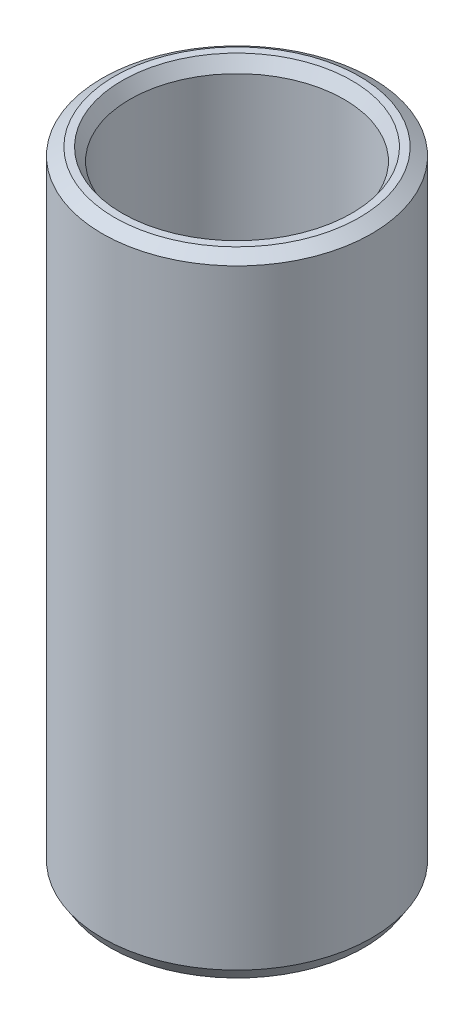
ISO-10303-21;
HEADER;
FILE_DESCRIPTION(('STEP AP214'),'2;1');
FILE_NAME('part.step','',(''),(''),'','','');
FILE_SCHEMA(('AUTOMOTIVE_DESIGN { 1 0 10303 214 1 1 1 1 }'));
ENDSEC;
DATA;
#1=APPLICATION_CONTEXT('core data for automotive mechanical design processes');
#2=APPLICATION_PROTOCOL_DEFINITION('international standard','automotive_design',2000,#1);
#3=PRODUCT_CONTEXT('',#1,'mechanical');
#4=PRODUCT('Part','Part','',(#3));
#5=PRODUCT_RELATED_PRODUCT_CATEGORY('part','',(#4));
#6=PRODUCT_DEFINITION_FORMATION('','',#4);
#7=PRODUCT_DEFINITION_CONTEXT('part definition',#1,'design');
#8=PRODUCT_DEFINITION('design','',#6,#7);
#9=PRODUCT_DEFINITION_SHAPE('','',#8);
#10=(LENGTH_UNIT() NAMED_UNIT(*) SI_UNIT(.MILLI.,.METRE.));
#11=(NAMED_UNIT(*) PLANE_ANGLE_UNIT() SI_UNIT($,.RADIAN.));
#12=(NAMED_UNIT(*) SI_UNIT($,.STERADIAN.) SOLID_ANGLE_UNIT());
#13=UNCERTAINTY_MEASURE_WITH_UNIT(LENGTH_MEASURE(1.E-05),#10,'distance_accuracy_value','');
#14=(GEOMETRIC_REPRESENTATION_CONTEXT(3) GLOBAL_UNCERTAINTY_ASSIGNED_CONTEXT((#13)) GLOBAL_UNIT_ASSIGNED_CONTEXT((#10,
#11,#12)) REPRESENTATION_CONTEXT('',''));
#15=CARTESIAN_POINT('',(0.,0.,0.));
#16=DIRECTION('',(0.,0.,1.));
#17=DIRECTION('',(1.,0.,0.));
#18=AXIS2_PLACEMENT_3D('',#15,#16,#17);
#19=CARTESIAN_POINT('',(0.,163.63805403778,0.));
#20=DIRECTION('',(0.,-1.,0.));
#21=DIRECTION('',(0.,0.,-1.));
#22=AXIS2_PLACEMENT_3D('',#19,#20,#21);
#23=CYLINDRICAL_SURFACE('',#22,35.);
#24=CARTESIAN_POINT('',(0.,3.19734779818565,0.));
#25=DIRECTION('',(0.,1.,0.));
#26=DIRECTION('',(0.,0.,1.));
#27=AXIS2_PLACEMENT_3D('',#24,#25,#26);
#28=CIRCLE('',#27,35.);
#29=CARTESIAN_POINT('',(0.,3.19734779818565,35.));
#30=VERTEX_POINT('',#29);
#31=EDGE_CURVE('E10',#30,#30,#28,.T.);
#32=ORIENTED_EDGE('',*,*,#31,.T.);
#33=EDGE_LOOP('',(#32));
#34=FACE_BOUND('',#33,.T.);
#35=CARTESIAN_POINT('',(0.,161.61145353073,0.));
#36=DIRECTION('',(0.,1.,0.));
#37=DIRECTION('',(0.,0.,1.));
#38=AXIS2_PLACEMENT_3D('',#35,#36,#37);
#39=CIRCLE('',#38,35.);
#40=CARTESIAN_POINT('',(0.,161.61145353073,35.));
#41=VERTEX_POINT('',#40);
#42=EDGE_CURVE('E50',#41,#41,#39,.F.);
#43=ORIENTED_EDGE('',*,*,#42,.T.);
#44=EDGE_LOOP('',(#43));
#45=FACE_BOUND('',#44,.T.);
#46=ADVANCED_FACE('F39',(#34,#45),#23,.T.);
#47=CARTESIAN_POINT('',(0.,163.63805403778,0.));
#48=DIRECTION('',(0.,1.,0.));
#49=DIRECTION('',(0.,0.,1.));
#50=AXIS2_PLACEMENT_3D('',#47,#48,#49);
#51=PLANE('',#50);
#52=CARTESIAN_POINT('',(0.,163.63805403778,0.));
#53=DIRECTION('',(0.,1.,0.));
#54=DIRECTION('',(0.,0.,1.));
#55=AXIS2_PLACEMENT_3D('',#52,#53,#54);
#56=CIRCLE('',#55,29.8465882350042);
#57=CARTESIAN_POINT('',(0.,163.63805403778,29.8465882350042));
#58=VERTEX_POINT('',#57);
#59=EDGE_CURVE('E58',#58,#58,#56,.F.);
#60=ORIENTED_EDGE('',*,*,#59,.T.);
#61=EDGE_LOOP('',(#60));
#62=FACE_BOUND('',#61,.T.);
#63=CARTESIAN_POINT('',(0.,163.63805403778,0.));
#64=DIRECTION('',(0.,1.,0.));
#65=DIRECTION('',(0.,0.,1.));
#66=AXIS2_PLACEMENT_3D('',#63,#64,#65);
#67=CIRCLE('',#66,31.8026522018143);
#68=CARTESIAN_POINT('',(0.,163.63805403778,31.8026522018143));
#69=VERTEX_POINT('',#68);
#70=EDGE_CURVE('E61',#69,#69,#67,.T.);
#71=ORIENTED_EDGE('',*,*,#70,.T.);
#72=EDGE_LOOP('',(#71));
#73=FACE_BOUND('',#72,.T.);
#74=ADVANCED_FACE('F88',(#62,#73),#51,.T.);
#75=CARTESIAN_POINT('',(0.,0.,0.));
#76=DIRECTION('',(0.,1.,0.));
#77=DIRECTION('',(0.,0.,1.));
#78=AXIS2_PLACEMENT_3D('',#75,#76,#77);
#79=PLANE('',#78);
#80=CARTESIAN_POINT('',(0.,0.,0.));
#81=DIRECTION('',(0.,1.,0.));
#82=DIRECTION('',(0.,0.,1.));
#83=AXIS2_PLACEMENT_3D('',#80,#81,#82);
#84=CIRCLE('',#83,31.0173355261397);
#85=CARTESIAN_POINT('',(0.,0.,31.0173355261397));
#86=VERTEX_POINT('',#85);
#87=EDGE_CURVE('E51',#86,#86,#84,.T.);
#88=ORIENTED_EDGE('',*,*,#87,.T.);
#89=EDGE_LOOP('',(#88));
#90=FACE_BOUND('',#89,.T.);
#91=CARTESIAN_POINT('',(0.,0.,0.));
#92=DIRECTION('',(0.,1.,0.));
#93=DIRECTION('',(0.,0.,1.));
#94=AXIS2_PLACEMENT_3D('',#91,#92,#93);
#95=CIRCLE('',#94,32.9733994929498);
#96=CARTESIAN_POINT('',(0.,0.,32.9733994929498));
#97=VERTEX_POINT('',#96);
#98=EDGE_CURVE('E54',#97,#97,#95,.F.);
#99=ORIENTED_EDGE('',*,*,#98,.T.);
#100=EDGE_LOOP('',(#99));
#101=FACE_BOUND('',#100,.T.);
#102=ADVANCED_FACE('F83',(#90,#101),#79,.F.);
#103=CARTESIAN_POINT('',(0.,163.63805403778,0.));
#104=DIRECTION('',(0.,-1.,0.));
#105=DIRECTION('',(0.,0.,-1.));
#106=AXIS2_PLACEMENT_3D('',#103,#104,#105);
#107=CYLINDRICAL_SURFACE('',#106,27.8199877279541);
#108=CARTESIAN_POINT('',(0.,160.440706239594,0.));
#109=DIRECTION('',(0.,1.,0.));
#110=DIRECTION('',(0.,0.,1.));
#111=AXIS2_PLACEMENT_3D('',#108,#109,#110);
#112=CIRCLE('',#111,27.8199877279541);
#113=CARTESIAN_POINT('',(0.,160.440706239594,27.8199877279541));
#114=VERTEX_POINT('',#113);
#115=EDGE_CURVE('E67',#114,#114,#112,.T.);
#116=ORIENTED_EDGE('',*,*,#115,.T.);
#117=EDGE_LOOP('',(#116));
#118=FACE_BOUND('',#117,.T.);
#119=CARTESIAN_POINT('',(0.,2.02660050705014,0.));
#120=DIRECTION('',(0.,1.,0.));
#121=DIRECTION('',(0.,0.,1.));
#122=AXIS2_PLACEMENT_3D('',#119,#120,#121);
#123=CIRCLE('',#122,27.8199877279541);
#124=CARTESIAN_POINT('',(0.,2.02660050705014,27.8199877279541));
#125=VERTEX_POINT('',#124);
#126=EDGE_CURVE('E69',#125,#125,#123,.F.);
#127=ORIENTED_EDGE('',*,*,#126,.T.);
#128=EDGE_LOOP('',(#127));
#129=FACE_BOUND('',#128,.T.);
#130=ADVANCED_FACE('F71',(#118,#129),#107,.F.);
#131=CARTESIAN_POINT('',(0.,160.440706239594,0.));
#132=DIRECTION('',(0.,1.,0.));
#133=DIRECTION('',(0.,0.,1.));
#134=AXIS2_PLACEMENT_3D('',#131,#132,#133);
#135=CONICAL_SURFACE('',#134,27.8199877279541,0.564929495882043);
#136=ORIENTED_EDGE('',*,*,#59,.F.);
#137=EDGE_LOOP('',(#136));
#138=FACE_BOUND('',#137,.T.);
#139=ORIENTED_EDGE('',*,*,#115,.F.);
#140=EDGE_LOOP('',(#139));
#141=FACE_BOUND('',#140,.T.);
#142=ADVANCED_FACE('F77',(#138,#141),#135,.F.);
#143=CARTESIAN_POINT('',(0.,0.,0.));
#144=DIRECTION('',(0.,-1.,0.));
#145=DIRECTION('',(0.,0.,-1.));
#146=AXIS2_PLACEMENT_3D('',#143,#144,#145);
#147=CONICAL_SURFACE('',#146,31.0173355261397,1.00586683091285);
#148=ORIENTED_EDGE('',*,*,#126,.F.);
#149=EDGE_LOOP('',(#148));
#150=FACE_BOUND('',#149,.T.);
#151=ORIENTED_EDGE('',*,*,#87,.F.);
#152=EDGE_LOOP('',(#151));
#153=FACE_BOUND('',#152,.T.);
#154=ADVANCED_FACE('F73',(#150,#153),#147,.F.);
#155=CARTESIAN_POINT('',(0.,3.19734779818565,0.));
#156=DIRECTION('',(0.,1.,0.));
#157=DIRECTION('',(0.,0.,1.));
#158=AXIS2_PLACEMENT_3D('',#155,#156,#157);
#159=CONICAL_SURFACE('',#158,35.,0.564929495882051);
#160=ORIENTED_EDGE('',*,*,#98,.F.);
#161=EDGE_LOOP('',(#160));
#162=FACE_BOUND('',#161,.T.);
#163=ORIENTED_EDGE('',*,*,#31,.F.);
#164=EDGE_LOOP('',(#163));
#165=FACE_BOUND('',#164,.T.);
#166=ADVANCED_FACE('F76',(#162,#165),#159,.T.);
#167=CARTESIAN_POINT('',(0.,163.63805403778,0.));
#168=DIRECTION('',(0.,-1.,0.));
#169=DIRECTION('',(0.,0.,-1.));
#170=AXIS2_PLACEMENT_3D('',#167,#168,#169);
#171=CONICAL_SURFACE('',#170,31.8026522018143,1.00586683091285);
#172=ORIENTED_EDGE('',*,*,#42,.F.);
#173=EDGE_LOOP('',(#172));
#174=FACE_BOUND('',#173,.T.);
#175=ORIENTED_EDGE('',*,*,#70,.F.);
#176=EDGE_LOOP('',(#175));
#177=FACE_BOUND('',#176,.T.);
#178=ADVANCED_FACE('F45',(#174,#177),#171,.T.);
#179=CLOSED_SHELL('',(#46,#74,#102,#130,#142,#154,#166,#178));
#180=MANIFOLD_SOLID_BREP('B2',#179);
#181=ADVANCED_BREP_SHAPE_REPRESENTATION('',(#18,#180),#14);
#182=SHAPE_DEFINITION_REPRESENTATION(#9,#181);
ENDSEC;
END-ISO-10303-21;
